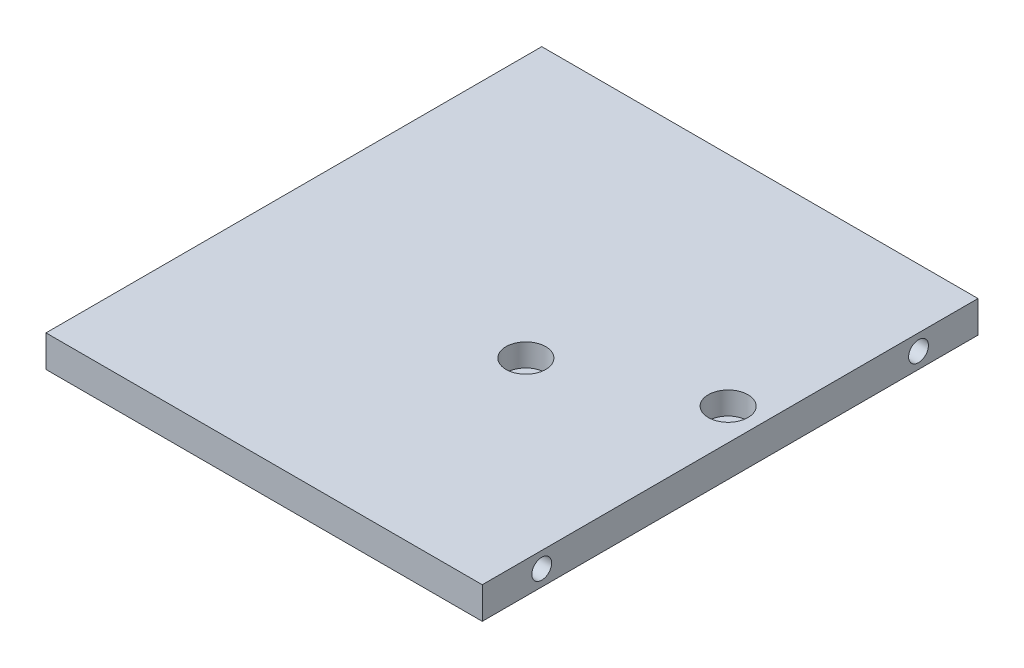
ISO-10303-21;
HEADER;
FILE_DESCRIPTION(('STEP AP214'),'2;1');
FILE_NAME('part.step','',(''),(''),'','','');
FILE_SCHEMA(('AUTOMOTIVE_DESIGN { 1 0 10303 214 1 1 1 1 }'));
ENDSEC;
DATA;
#1=APPLICATION_CONTEXT('core data for automotive mechanical design processes');
#2=APPLICATION_PROTOCOL_DEFINITION('international standard','automotive_design',2000,#1);
#3=PRODUCT_CONTEXT('',#1,'mechanical');
#4=PRODUCT('Part','Part','',(#3));
#5=PRODUCT_RELATED_PRODUCT_CATEGORY('part','',(#4));
#6=PRODUCT_DEFINITION_FORMATION('','',#4);
#7=PRODUCT_DEFINITION_CONTEXT('part definition',#1,'design');
#8=PRODUCT_DEFINITION('design','',#6,#7);
#9=PRODUCT_DEFINITION_SHAPE('','',#8);
#10=(LENGTH_UNIT() NAMED_UNIT(*) SI_UNIT(.MILLI.,.METRE.));
#11=(NAMED_UNIT(*) PLANE_ANGLE_UNIT() SI_UNIT($,.RADIAN.));
#12=(NAMED_UNIT(*) SI_UNIT($,.STERADIAN.) SOLID_ANGLE_UNIT());
#13=UNCERTAINTY_MEASURE_WITH_UNIT(LENGTH_MEASURE(1.E-05),#10,'distance_accuracy_value','');
#14=(GEOMETRIC_REPRESENTATION_CONTEXT(3) GLOBAL_UNCERTAINTY_ASSIGNED_CONTEXT((#13)) GLOBAL_UNIT_ASSIGNED_CONTEXT((#10,
#11,#12)) REPRESENTATION_CONTEXT('',''));
#15=CARTESIAN_POINT('',(0.,0.,0.));
#16=DIRECTION('',(0.,0.,1.));
#17=DIRECTION('',(1.,0.,0.));
#18=AXIS2_PLACEMENT_3D('',#15,#16,#17);
#19=CARTESIAN_POINT('',(11.,0.,7.49999999999999));
#20=DIRECTION('',(0.,1.,0.));
#21=DIRECTION('',(0.,0.,1.));
#22=AXIS2_PLACEMENT_3D('',#19,#20,#21);
#23=CYLINDRICAL_SURFACE('',#22,2.75);
#24=CARTESIAN_POINT('',(11.,0.,7.49999999999999));
#25=DIRECTION('',(0.,1.,0.));
#26=DIRECTION('',(0.,0.,1.));
#27=AXIS2_PLACEMENT_3D('',#24,#25,#26);
#28=CIRCLE('',#27,2.75);
#29=CARTESIAN_POINT('',(11.,0.,10.25));
#30=VERTEX_POINT('',#29);
#31=EDGE_CURVE('E172',#30,#30,#28,.T.);
#32=ORIENTED_EDGE('',*,*,#31,.F.);
#33=EDGE_LOOP('',(#32));
#34=FACE_BOUND('',#33,.T.);
#35=CARTESIAN_POINT('',(11.,2.3,7.49999999999999));
#36=DIRECTION('',(0.,1.,0.));
#37=DIRECTION('',(0.,0.,1.));
#38=AXIS2_PLACEMENT_3D('',#35,#36,#37);
#39=CIRCLE('',#38,2.75);
#40=CARTESIAN_POINT('',(11.,2.3,10.25));
#41=VERTEX_POINT('',#40);
#42=EDGE_CURVE('E40',#41,#41,#39,.F.);
#43=ORIENTED_EDGE('',*,*,#42,.F.);
#44=EDGE_LOOP('',(#43));
#45=FACE_BOUND('',#44,.T.);
#46=ADVANCED_FACE('F36',(#34,#45),#23,.F.);
#47=CARTESIAN_POINT('',(47.,0.,-7.50000000000002));
#48=DIRECTION('',(0.,1.,0.));
#49=DIRECTION('',(0.,0.,1.));
#50=AXIS2_PLACEMENT_3D('',#47,#48,#49);
#51=CYLINDRICAL_SURFACE('',#50,2.75);
#52=CARTESIAN_POINT('',(47.,0.,-7.50000000000002));
#53=DIRECTION('',(0.,1.,0.));
#54=DIRECTION('',(0.,0.,1.));
#55=AXIS2_PLACEMENT_3D('',#52,#53,#54);
#56=CIRCLE('',#55,2.75);
#57=CARTESIAN_POINT('',(47.,0.,-4.75000000000002));
#58=VERTEX_POINT('',#57);
#59=EDGE_CURVE('E113',#58,#58,#56,.T.);
#60=ORIENTED_EDGE('',*,*,#59,.F.);
#61=EDGE_LOOP('',(#60));
#62=FACE_BOUND('',#61,.T.);
#63=CARTESIAN_POINT('',(47.,2.3,-7.50000000000002));
#64=DIRECTION('',(0.,1.,0.));
#65=DIRECTION('',(0.,0.,1.));
#66=AXIS2_PLACEMENT_3D('',#63,#64,#65);
#67=CIRCLE('',#66,2.75);
#68=CARTESIAN_POINT('',(47.,2.3,-4.75000000000002));
#69=VERTEX_POINT('',#68);
#70=EDGE_CURVE('E123',#69,#69,#67,.F.);
#71=ORIENTED_EDGE('',*,*,#70,.F.);
#72=EDGE_LOOP('',(#71));
#73=FACE_BOUND('',#72,.T.);
#74=ADVANCED_FACE('F214',(#62,#73),#51,.F.);
#75=CARTESIAN_POINT('',(55.,8.,-62.5));
#76=DIRECTION('',(-1.,0.,0.));
#77=DIRECTION('',(0.,0.,1.));
#78=AXIS2_PLACEMENT_3D('',#75,#76,#77);
#79=PLANE('',#78);
#80=CARTESIAN_POINT('',(55.,4.,-47.5));
#81=DIRECTION('',(1.,0.,0.));
#82=DIRECTION('',(0.,0.,-1.));
#83=AXIS2_PLACEMENT_3D('',#80,#81,#82);
#84=CIRCLE('',#83,2.5);
#85=CARTESIAN_POINT('',(55.,4.,-50.));
#86=VERTEX_POINT('',#85);
#87=EDGE_CURVE('E157',#86,#86,#84,.T.);
#88=ORIENTED_EDGE('',*,*,#87,.F.);
#89=EDGE_LOOP('',(#88));
#90=FACE_BOUND('',#89,.T.);
#91=CARTESIAN_POINT('',(55.,4.,47.5));
#92=DIRECTION('',(1.,0.,0.));
#93=DIRECTION('',(0.,0.,-1.));
#94=AXIS2_PLACEMENT_3D('',#91,#92,#93);
#95=CIRCLE('',#94,2.49999999999999);
#96=CARTESIAN_POINT('',(55.,4.,45.));
#97=VERTEX_POINT('',#96);
#98=EDGE_CURVE('E133',#97,#97,#95,.T.);
#99=ORIENTED_EDGE('',*,*,#98,.F.);
#100=EDGE_LOOP('',(#99));
#101=FACE_BOUND('',#100,.T.);
#102=DIRECTION('',(0.,0.,-1.));
#103=VECTOR('',#102,1.);
#104=CARTESIAN_POINT('',(55.,0.,-62.5));
#105=LINE('',#104,#103);
#106=CARTESIAN_POINT('',(55.,0.,62.5));
#107=VERTEX_POINT('',#106);
#108=CARTESIAN_POINT('',(55.,0.,-62.5));
#109=VERTEX_POINT('',#108);
#110=EDGE_CURVE('E109',#107,#109,#105,.T.);
#111=ORIENTED_EDGE('',*,*,#110,.T.);
#112=DIRECTION('',(0.,-1.,0.));
#113=VECTOR('',#112,1.);
#114=CARTESIAN_POINT('',(55.,8.,-62.5));
#115=LINE('',#114,#113);
#116=CARTESIAN_POINT('',(55.,8.,-62.5));
#117=VERTEX_POINT('',#116);
#118=EDGE_CURVE('E11',#117,#109,#115,.T.);
#119=ORIENTED_EDGE('',*,*,#118,.F.);
#120=DIRECTION('',(0.,0.,-1.));
#121=VECTOR('',#120,1.);
#122=CARTESIAN_POINT('',(55.,8.,-62.5));
#123=LINE('',#122,#121);
#124=CARTESIAN_POINT('',(55.,8.,62.5));
#125=VERTEX_POINT('',#124);
#126=EDGE_CURVE('E91',#125,#117,#123,.T.);
#127=ORIENTED_EDGE('',*,*,#126,.F.);
#128=DIRECTION('',(0.,-1.,0.));
#129=VECTOR('',#128,1.);
#130=CARTESIAN_POINT('',(55.,8.,62.5));
#131=LINE('',#130,#129);
#132=EDGE_CURVE('E105',#125,#107,#131,.T.);
#133=ORIENTED_EDGE('',*,*,#132,.T.);
#134=EDGE_LOOP('',(#111,#119,#127,#133));
#135=FACE_BOUND('',#134,.T.);
#136=ADVANCED_FACE('F38',(#90,#101,#135),#79,.F.);
#137=CARTESIAN_POINT('',(-55.,8.,-62.5));
#138=DIRECTION('',(0.,0.,1.));
#139=DIRECTION('',(1.,0.,0.));
#140=AXIS2_PLACEMENT_3D('',#137,#138,#139);
#141=PLANE('',#140);
#142=DIRECTION('',(-1.,0.,0.));
#143=VECTOR('',#142,1.);
#144=CARTESIAN_POINT('',(-55.,0.,-62.5));
#145=LINE('',#144,#143);
#146=CARTESIAN_POINT('',(-55.,0.,-62.5));
#147=VERTEX_POINT('',#146);
#148=EDGE_CURVE('E96',#109,#147,#145,.T.);
#149=ORIENTED_EDGE('',*,*,#148,.T.);
#150=DIRECTION('',(0.,-1.,0.));
#151=VECTOR('',#150,1.);
#152=CARTESIAN_POINT('',(-55.,8.,-62.5));
#153=LINE('',#152,#151);
#154=CARTESIAN_POINT('',(-55.,8.,-62.5));
#155=VERTEX_POINT('',#154);
#156=EDGE_CURVE('E47',#155,#147,#153,.T.);
#157=ORIENTED_EDGE('',*,*,#156,.F.);
#158=DIRECTION('',(-1.,0.,0.));
#159=VECTOR('',#158,1.);
#160=CARTESIAN_POINT('',(-55.,8.,-62.5));
#161=LINE('',#160,#159);
#162=EDGE_CURVE('E86',#117,#155,#161,.T.);
#163=ORIENTED_EDGE('',*,*,#162,.F.);
#164=ORIENTED_EDGE('',*,*,#118,.T.);
#165=EDGE_LOOP('',(#149,#157,#163,#164));
#166=FACE_BOUND('',#165,.T.);
#167=ADVANCED_FACE('F95',(#166),#141,.F.);
#168=CARTESIAN_POINT('',(-55.,8.,-62.5));
#169=DIRECTION('',(1.,0.,0.));
#170=DIRECTION('',(0.,0.,-1.));
#171=AXIS2_PLACEMENT_3D('',#168,#169,#170);
#172=PLANE('',#171);
#173=CARTESIAN_POINT('',(-55.,4.,47.5));
#174=DIRECTION('',(-1.,0.,0.));
#175=DIRECTION('',(0.,0.,1.));
#176=AXIS2_PLACEMENT_3D('',#173,#174,#175);
#177=CIRCLE('',#176,2.5);
#178=CARTESIAN_POINT('',(-55.,4.,50.));
#179=VERTEX_POINT('',#178);
#180=EDGE_CURVE('E173',#179,#179,#177,.T.);
#181=ORIENTED_EDGE('',*,*,#180,.F.);
#182=EDGE_LOOP('',(#181));
#183=FACE_BOUND('',#182,.T.);
#184=CARTESIAN_POINT('',(-55.,4.,-47.5));
#185=DIRECTION('',(-1.,0.,0.));
#186=DIRECTION('',(0.,0.,1.));
#187=AXIS2_PLACEMENT_3D('',#184,#185,#186);
#188=CIRCLE('',#187,2.5);
#189=CARTESIAN_POINT('',(-55.,4.,-45.));
#190=VERTEX_POINT('',#189);
#191=EDGE_CURVE('E156',#190,#190,#188,.T.);
#192=ORIENTED_EDGE('',*,*,#191,.F.);
#193=EDGE_LOOP('',(#192));
#194=FACE_BOUND('',#193,.T.);
#195=DIRECTION('',(0.,0.,1.));
#196=VECTOR('',#195,1.);
#197=CARTESIAN_POINT('',(-55.,0.,-62.5));
#198=LINE('',#197,#196);
#199=CARTESIAN_POINT('',(-55.,0.,62.5));
#200=VERTEX_POINT('',#199);
#201=EDGE_CURVE('E73',#147,#200,#198,.T.);
#202=ORIENTED_EDGE('',*,*,#201,.T.);
#203=DIRECTION('',(0.,-1.,0.));
#204=VECTOR('',#203,1.);
#205=CARTESIAN_POINT('',(-55.,8.,62.5));
#206=LINE('',#205,#204);
#207=CARTESIAN_POINT('',(-55.,8.,62.5));
#208=VERTEX_POINT('',#207);
#209=EDGE_CURVE('E98',#208,#200,#206,.T.);
#210=ORIENTED_EDGE('',*,*,#209,.F.);
#211=DIRECTION('',(0.,0.,1.));
#212=VECTOR('',#211,1.);
#213=CARTESIAN_POINT('',(-55.,8.,-62.5));
#214=LINE('',#213,#212);
#215=EDGE_CURVE('E89',#155,#208,#214,.T.);
#216=ORIENTED_EDGE('',*,*,#215,.F.);
#217=ORIENTED_EDGE('',*,*,#156,.T.);
#218=EDGE_LOOP('',(#202,#210,#216,#217));
#219=FACE_BOUND('',#218,.T.);
#220=ADVANCED_FACE('F100',(#183,#194,#219),#172,.F.);
#221=CARTESIAN_POINT('',(-55.,8.,62.5));
#222=DIRECTION('',(0.,0.,-1.));
#223=DIRECTION('',(-1.,0.,0.));
#224=AXIS2_PLACEMENT_3D('',#221,#222,#223);
#225=PLANE('',#224);
#226=DIRECTION('',(1.,0.,0.));
#227=VECTOR('',#226,1.);
#228=CARTESIAN_POINT('',(-55.,0.,62.5));
#229=LINE('',#228,#227);
#230=EDGE_CURVE('E79',#200,#107,#229,.T.);
#231=ORIENTED_EDGE('',*,*,#230,.T.);
#232=ORIENTED_EDGE('',*,*,#132,.F.);
#233=DIRECTION('',(1.,0.,0.));
#234=VECTOR('',#233,1.);
#235=CARTESIAN_POINT('',(-55.,8.,62.5));
#236=LINE('',#235,#234);
#237=EDGE_CURVE('E56',#208,#125,#236,.T.);
#238=ORIENTED_EDGE('',*,*,#237,.F.);
#239=ORIENTED_EDGE('',*,*,#209,.T.);
#240=EDGE_LOOP('',(#231,#232,#238,#239));
#241=FACE_BOUND('',#240,.T.);
#242=ADVANCED_FACE('F273',(#241),#225,.F.);
#243=CARTESIAN_POINT('',(0.,8.,0.));
#244=DIRECTION('',(0.,1.,0.));
#245=DIRECTION('',(0.,0.,1.));
#246=AXIS2_PLACEMENT_3D('',#243,#244,#245);
#247=PLANE('',#246);
#248=CARTESIAN_POINT('',(11.,8.,7.49999999999999));
#249=DIRECTION('',(0.,1.,0.));
#250=DIRECTION('',(0.,0.,1.));
#251=AXIS2_PLACEMENT_3D('',#248,#249,#250);
#252=CIRCLE('',#251,5.);
#253=CARTESIAN_POINT('',(11.,8.,12.5));
#254=VERTEX_POINT('',#253);
#255=EDGE_CURVE('E135',#254,#254,#252,.T.);
#256=ORIENTED_EDGE('',*,*,#255,.F.);
#257=EDGE_LOOP('',(#256));
#258=FACE_BOUND('',#257,.T.);
#259=CARTESIAN_POINT('',(47.,8.,-7.50000000000002));
#260=DIRECTION('',(0.,1.,0.));
#261=DIRECTION('',(0.,0.,1.));
#262=AXIS2_PLACEMENT_3D('',#259,#260,#261);
#263=CIRCLE('',#262,5.);
#264=CARTESIAN_POINT('',(47.,8.,-2.50000000000002));
#265=VERTEX_POINT('',#264);
#266=EDGE_CURVE('E148',#265,#265,#263,.T.);
#267=ORIENTED_EDGE('',*,*,#266,.F.);
#268=EDGE_LOOP('',(#267));
#269=FACE_BOUND('',#268,.T.);
#270=ORIENTED_EDGE('',*,*,#126,.T.);
#271=ORIENTED_EDGE('',*,*,#162,.T.);
#272=ORIENTED_EDGE('',*,*,#215,.T.);
#273=ORIENTED_EDGE('',*,*,#237,.T.);
#274=EDGE_LOOP('',(#270,#271,#272,#273));
#275=FACE_BOUND('',#274,.T.);
#276=ADVANCED_FACE('F87',(#258,#269,#275),#247,.T.);
#277=CARTESIAN_POINT('',(0.,0.,0.));
#278=DIRECTION('',(0.,1.,0.));
#279=DIRECTION('',(0.,0.,1.));
#280=AXIS2_PLACEMENT_3D('',#277,#278,#279);
#281=PLANE('',#280);
#282=ORIENTED_EDGE('',*,*,#59,.T.);
#283=EDGE_LOOP('',(#282));
#284=FACE_BOUND('',#283,.T.);
#285=ORIENTED_EDGE('',*,*,#31,.T.);
#286=EDGE_LOOP('',(#285));
#287=FACE_BOUND('',#286,.T.);
#288=ORIENTED_EDGE('',*,*,#110,.F.);
#289=ORIENTED_EDGE('',*,*,#230,.F.);
#290=ORIENTED_EDGE('',*,*,#201,.F.);
#291=ORIENTED_EDGE('',*,*,#148,.F.);
#292=EDGE_LOOP('',(#288,#289,#290,#291));
#293=FACE_BOUND('',#292,.T.);
#294=ADVANCED_FACE('F209',(#284,#287,#293),#281,.F.);
#295=CARTESIAN_POINT('',(-40.,4.,-47.5));
#296=DIRECTION('',(-1.,0.,0.));
#297=DIRECTION('',(0.,0.,1.));
#298=AXIS2_PLACEMENT_3D('',#295,#296,#297);
#299=CYLINDRICAL_SURFACE('',#298,2.5);
#300=CARTESIAN_POINT('',(-40.,4.,-47.5));
#301=DIRECTION('',(-1.,0.,0.));
#302=DIRECTION('',(0.,0.,1.));
#303=AXIS2_PLACEMENT_3D('',#300,#301,#302);
#304=CIRCLE('',#303,2.5);
#305=CARTESIAN_POINT('',(-40.,4.,-45.));
#306=VERTEX_POINT('',#305);
#307=EDGE_CURVE('E177',#306,#306,#304,.T.);
#308=ORIENTED_EDGE('',*,*,#307,.F.);
#309=EDGE_LOOP('',(#308));
#310=FACE_BOUND('',#309,.T.);
#311=ORIENTED_EDGE('',*,*,#191,.T.);
#312=EDGE_LOOP('',(#311));
#313=FACE_BOUND('',#312,.T.);
#314=ADVANCED_FACE('F263',(#310,#313),#299,.F.);
#315=CARTESIAN_POINT('',(-40.,4.,-47.5));
#316=DIRECTION('',(-1.,0.,0.));
#317=DIRECTION('',(0.,0.,1.));
#318=AXIS2_PLACEMENT_3D('',#315,#316,#317);
#319=PLANE('',#318);
#320=ORIENTED_EDGE('',*,*,#307,.T.);
#321=EDGE_LOOP('',(#320));
#322=FACE_BOUND('',#321,.T.);
#323=ADVANCED_FACE('F259',(#322),#319,.T.);
#324=CARTESIAN_POINT('',(-40.,4.,47.5));
#325=DIRECTION('',(-1.,0.,0.));
#326=DIRECTION('',(0.,0.,1.));
#327=AXIS2_PLACEMENT_3D('',#324,#325,#326);
#328=CYLINDRICAL_SURFACE('',#327,2.5);
#329=CARTESIAN_POINT('',(-40.,4.,47.5));
#330=DIRECTION('',(-1.,0.,0.));
#331=DIRECTION('',(0.,0.,1.));
#332=AXIS2_PLACEMENT_3D('',#329,#330,#331);
#333=CIRCLE('',#332,2.5);
#334=CARTESIAN_POINT('',(-40.,4.,50.));
#335=VERTEX_POINT('',#334);
#336=EDGE_CURVE('E168',#335,#335,#333,.T.);
#337=ORIENTED_EDGE('',*,*,#336,.F.);
#338=EDGE_LOOP('',(#337));
#339=FACE_BOUND('',#338,.T.);
#340=ORIENTED_EDGE('',*,*,#180,.T.);
#341=EDGE_LOOP('',(#340));
#342=FACE_BOUND('',#341,.T.);
#343=ADVANCED_FACE('F255',(#339,#342),#328,.F.);
#344=CARTESIAN_POINT('',(-40.,4.,47.5));
#345=DIRECTION('',(-1.,0.,0.));
#346=DIRECTION('',(0.,0.,1.));
#347=AXIS2_PLACEMENT_3D('',#344,#345,#346);
#348=PLANE('',#347);
#349=ORIENTED_EDGE('',*,*,#336,.T.);
#350=EDGE_LOOP('',(#349));
#351=FACE_BOUND('',#350,.T.);
#352=ADVANCED_FACE('F251',(#351),#348,.T.);
#353=CARTESIAN_POINT('',(40.,4.,47.5));
#354=DIRECTION('',(1.,0.,0.));
#355=DIRECTION('',(0.,0.,-1.));
#356=AXIS2_PLACEMENT_3D('',#353,#354,#355);
#357=CYLINDRICAL_SURFACE('',#356,2.49999999999999);
#358=CARTESIAN_POINT('',(40.,4.,47.5));
#359=DIRECTION('',(1.,0.,0.));
#360=DIRECTION('',(0.,0.,-1.));
#361=AXIS2_PLACEMENT_3D('',#358,#359,#360);
#362=CIRCLE('',#361,2.49999999999999);
#363=CARTESIAN_POINT('',(40.,4.,45.));
#364=VERTEX_POINT('',#363);
#365=EDGE_CURVE('E161',#364,#364,#362,.T.);
#366=ORIENTED_EDGE('',*,*,#365,.F.);
#367=EDGE_LOOP('',(#366));
#368=FACE_BOUND('',#367,.T.);
#369=ORIENTED_EDGE('',*,*,#98,.T.);
#370=EDGE_LOOP('',(#369));
#371=FACE_BOUND('',#370,.T.);
#372=ADVANCED_FACE('F247',(#368,#371),#357,.F.);
#373=CARTESIAN_POINT('',(40.,4.,47.5));
#374=DIRECTION('',(1.,0.,0.));
#375=DIRECTION('',(0.,0.,-1.));
#376=AXIS2_PLACEMENT_3D('',#373,#374,#375);
#377=PLANE('',#376);
#378=ORIENTED_EDGE('',*,*,#365,.T.);
#379=EDGE_LOOP('',(#378));
#380=FACE_BOUND('',#379,.T.);
#381=ADVANCED_FACE('F243',(#380),#377,.T.);
#382=CARTESIAN_POINT('',(40.,4.,-47.5));
#383=DIRECTION('',(1.,0.,0.));
#384=DIRECTION('',(0.,0.,-1.));
#385=AXIS2_PLACEMENT_3D('',#382,#383,#384);
#386=CYLINDRICAL_SURFACE('',#385,2.5);
#387=CARTESIAN_POINT('',(40.,4.,-47.5));
#388=DIRECTION('',(1.,0.,0.));
#389=DIRECTION('',(0.,0.,-1.));
#390=AXIS2_PLACEMENT_3D('',#387,#388,#389);
#391=CIRCLE('',#390,2.5);
#392=CARTESIAN_POINT('',(40.,4.,-50.));
#393=VERTEX_POINT('',#392);
#394=EDGE_CURVE('E152',#393,#393,#391,.T.);
#395=ORIENTED_EDGE('',*,*,#394,.F.);
#396=EDGE_LOOP('',(#395));
#397=FACE_BOUND('',#396,.T.);
#398=ORIENTED_EDGE('',*,*,#87,.T.);
#399=EDGE_LOOP('',(#398));
#400=FACE_BOUND('',#399,.T.);
#401=ADVANCED_FACE('F239',(#397,#400),#386,.F.);
#402=CARTESIAN_POINT('',(40.,4.,-47.5));
#403=DIRECTION('',(1.,0.,0.));
#404=DIRECTION('',(0.,0.,-1.));
#405=AXIS2_PLACEMENT_3D('',#402,#403,#404);
#406=PLANE('',#405);
#407=ORIENTED_EDGE('',*,*,#394,.T.);
#408=EDGE_LOOP('',(#407));
#409=FACE_BOUND('',#408,.T.);
#410=ADVANCED_FACE('F234',(#409),#406,.T.);
#411=CARTESIAN_POINT('',(47.,2.3,-7.50000000000002));
#412=DIRECTION('',(0.,1.,0.));
#413=DIRECTION('',(0.,0.,1.));
#414=AXIS2_PLACEMENT_3D('',#411,#412,#413);
#415=PLANE('',#414);
#416=CARTESIAN_POINT('',(47.,2.3,-7.50000000000002));
#417=DIRECTION('',(0.,1.,0.));
#418=DIRECTION('',(0.,0.,1.));
#419=AXIS2_PLACEMENT_3D('',#416,#417,#418);
#420=CIRCLE('',#419,5.);
#421=CARTESIAN_POINT('',(47.,2.3,-2.50000000000002));
#422=VERTEX_POINT('',#421);
#423=EDGE_CURVE('E142',#422,#422,#420,.T.);
#424=ORIENTED_EDGE('',*,*,#423,.T.);
#425=EDGE_LOOP('',(#424));
#426=FACE_BOUND('',#425,.T.);
#427=ORIENTED_EDGE('',*,*,#70,.T.);
#428=EDGE_LOOP('',(#427));
#429=FACE_BOUND('',#428,.T.);
#430=ADVANCED_FACE('F229',(#426,#429),#415,.T.);
#431=CARTESIAN_POINT('',(47.,2.3,-7.50000000000002));
#432=DIRECTION('',(0.,1.,0.));
#433=DIRECTION('',(0.,0.,1.));
#434=AXIS2_PLACEMENT_3D('',#431,#432,#433);
#435=CYLINDRICAL_SURFACE('',#434,5.);
#436=ORIENTED_EDGE('',*,*,#423,.F.);
#437=EDGE_LOOP('',(#436));
#438=FACE_BOUND('',#437,.T.);
#439=ORIENTED_EDGE('',*,*,#266,.T.);
#440=EDGE_LOOP('',(#439));
#441=FACE_BOUND('',#440,.T.);
#442=ADVANCED_FACE('F221',(#438,#441),#435,.F.);
#443=CARTESIAN_POINT('',(11.,2.3,7.49999999999999));
#444=DIRECTION('',(0.,1.,0.));
#445=DIRECTION('',(0.,0.,1.));
#446=AXIS2_PLACEMENT_3D('',#443,#444,#445);
#447=PLANE('',#446);
#448=CARTESIAN_POINT('',(11.,2.3,7.49999999999999));
#449=DIRECTION('',(0.,1.,0.));
#450=DIRECTION('',(0.,0.,1.));
#451=AXIS2_PLACEMENT_3D('',#448,#449,#450);
#452=CIRCLE('',#451,5.);
#453=CARTESIAN_POINT('',(11.,2.3,12.5));
#454=VERTEX_POINT('',#453);
#455=EDGE_CURVE('E126',#454,#454,#452,.T.);
#456=ORIENTED_EDGE('',*,*,#455,.T.);
#457=EDGE_LOOP('',(#456));
#458=FACE_BOUND('',#457,.T.);
#459=ORIENTED_EDGE('',*,*,#42,.T.);
#460=EDGE_LOOP('',(#459));
#461=FACE_BOUND('',#460,.T.);
#462=ADVANCED_FACE('F218',(#458,#461),#447,.T.);
#463=CARTESIAN_POINT('',(11.,2.3,7.49999999999999));
#464=DIRECTION('',(0.,1.,0.));
#465=DIRECTION('',(0.,0.,1.));
#466=AXIS2_PLACEMENT_3D('',#463,#464,#465);
#467=CYLINDRICAL_SURFACE('',#466,5.);
#468=ORIENTED_EDGE('',*,*,#455,.F.);
#469=EDGE_LOOP('',(#468));
#470=FACE_BOUND('',#469,.T.);
#471=ORIENTED_EDGE('',*,*,#255,.T.);
#472=EDGE_LOOP('',(#471));
#473=FACE_BOUND('',#472,.T.);
#474=ADVANCED_FACE('F220',(#470,#473),#467,.F.);
#475=CLOSED_SHELL('',(#46,#74,#136,#167,#220,#242,#276,#294,#314,#323,#343,#352,#372,#381,#401,
#410,#430,#442,#462,#474));
#476=MANIFOLD_SOLID_BREP('B2',#475);
#477=ADVANCED_BREP_SHAPE_REPRESENTATION('',(#18,#476),#14);
#478=SHAPE_DEFINITION_REPRESENTATION(#9,#477);
ENDSEC;
END-ISO-10303-21;
